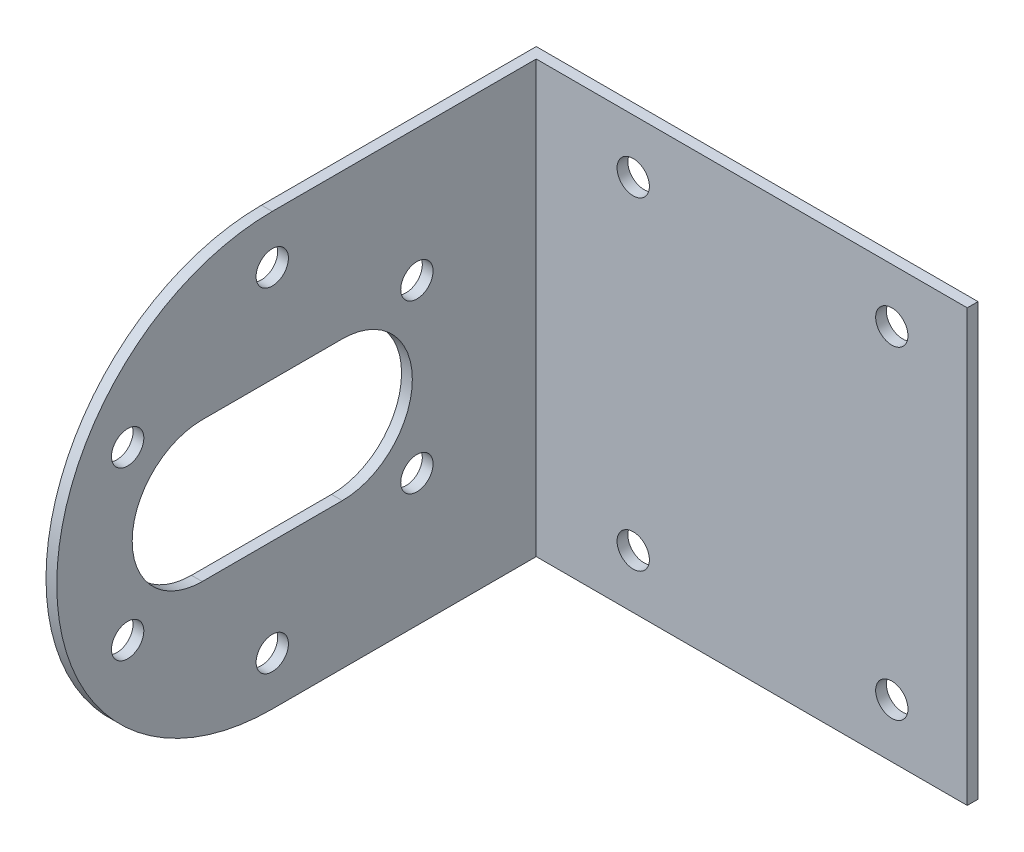
ISO-10303-21;
HEADER;
FILE_DESCRIPTION(('STEP AP214'),'2;1');
FILE_NAME('part.step','',(''),(''),'','','');
FILE_SCHEMA(('AUTOMOTIVE_DESIGN { 1 0 10303 214 1 1 1 1 }'));
ENDSEC;
DATA;
#1=APPLICATION_CONTEXT('core data for automotive mechanical design processes');
#2=APPLICATION_PROTOCOL_DEFINITION('international standard','automotive_design',2000,#1);
#3=PRODUCT_CONTEXT('',#1,'mechanical');
#4=PRODUCT('Part','Part','',(#3));
#5=PRODUCT_RELATED_PRODUCT_CATEGORY('part','',(#4));
#6=PRODUCT_DEFINITION_FORMATION('','',#4);
#7=PRODUCT_DEFINITION_CONTEXT('part definition',#1,'design');
#8=PRODUCT_DEFINITION('design','',#6,#7);
#9=PRODUCT_DEFINITION_SHAPE('','',#8);
#10=(LENGTH_UNIT() NAMED_UNIT(*) SI_UNIT(.MILLI.,.METRE.));
#11=(NAMED_UNIT(*) PLANE_ANGLE_UNIT() SI_UNIT($,.RADIAN.));
#12=(NAMED_UNIT(*) SI_UNIT($,.STERADIAN.) SOLID_ANGLE_UNIT());
#13=UNCERTAINTY_MEASURE_WITH_UNIT(LENGTH_MEASURE(1.E-05),#10,'distance_accuracy_value','');
#14=(GEOMETRIC_REPRESENTATION_CONTEXT(3) GLOBAL_UNCERTAINTY_ASSIGNED_CONTEXT((#13)) GLOBAL_UNIT_ASSIGNED_CONTEXT((#10,
#11,#12)) REPRESENTATION_CONTEXT('',''));
#15=CARTESIAN_POINT('',(0.,0.,0.));
#16=DIRECTION('',(0.,0.,1.));
#17=DIRECTION('',(1.,0.,0.));
#18=AXIS2_PLACEMENT_3D('',#15,#16,#17);
#19=CARTESIAN_POINT('',(0.,6.5,18.));
#20=DIRECTION('',(0.,-1.,0.));
#21=DIRECTION('',(0.,0.,-1.));
#22=AXIS2_PLACEMENT_3D('',#19,#20,#21);
#23=PLANE('',#22);
#24=DIRECTION('',(0.,0.,1.));
#25=VECTOR('',#24,1.);
#26=CARTESIAN_POINT('',(1.,6.5,0.));
#27=LINE('',#26,#25);
#28=CARTESIAN_POINT('',(1.,6.5,18.));
#29=VERTEX_POINT('',#28);
#30=CARTESIAN_POINT('',(1.,6.50000000000001,31.));
#31=VERTEX_POINT('',#30);
#32=EDGE_CURVE('E214',#29,#31,#27,.T.);
#33=ORIENTED_EDGE('',*,*,#32,.T.);
#34=DIRECTION('',(-1.,0.,0.));
#35=VECTOR('',#34,1.);
#36=CARTESIAN_POINT('',(0.,6.50000000000001,31.));
#37=LINE('',#36,#35);
#38=CARTESIAN_POINT('',(0.,6.5,31.));
#39=VERTEX_POINT('',#38);
#40=EDGE_CURVE('E109',#31,#39,#37,.T.);
#41=ORIENTED_EDGE('',*,*,#40,.T.);
#42=DIRECTION('',(0.,0.,-1.));
#43=VECTOR('',#42,1.);
#44=CARTESIAN_POINT('',(0.,6.5,0.));
#45=LINE('',#44,#43);
#46=CARTESIAN_POINT('',(0.,6.5,18.));
#47=VERTEX_POINT('',#46);
#48=EDGE_CURVE('E200',#39,#47,#45,.T.);
#49=ORIENTED_EDGE('',*,*,#48,.T.);
#50=DIRECTION('',(-1.,0.,0.));
#51=VECTOR('',#50,1.);
#52=CARTESIAN_POINT('',(0.,6.50000000000001,18.));
#53=LINE('',#52,#51);
#54=EDGE_CURVE('E132',#47,#29,#53,.F.);
#55=ORIENTED_EDGE('',*,*,#54,.T.);
#56=EDGE_LOOP('',(#33,#41,#49,#55));
#57=FACE_BOUND('',#56,.T.);
#58=ADVANCED_FACE('F17',(#57),#23,.T.);
#59=CARTESIAN_POINT('',(0.,7.75,37.923393758659));
#60=DIRECTION('',(-1.,0.,0.));
#61=DIRECTION('',(0.,0.,1.));
#62=AXIS2_PLACEMENT_3D('',#59,#60,#61);
#63=CYLINDRICAL_SURFACE('',#62,1.5);
#64=CARTESIAN_POINT('',(1.,7.75,37.923393758659));
#65=DIRECTION('',(-1.,0.,0.));
#66=DIRECTION('',(0.,0.,1.));
#67=AXIS2_PLACEMENT_3D('',#64,#65,#66);
#68=CIRCLE('',#67,1.5);
#69=CARTESIAN_POINT('',(0.999999999999999,7.75,39.423393758659));
#70=VERTEX_POINT('',#69);
#71=EDGE_CURVE('E218',#70,#70,#68,.F.);
#72=ORIENTED_EDGE('',*,*,#71,.T.);
#73=EDGE_LOOP('',(#72));
#74=FACE_BOUND('',#73,.T.);
#75=CARTESIAN_POINT('',(0.,7.75,37.923393758659));
#76=DIRECTION('',(-1.,0.,0.));
#77=DIRECTION('',(0.,0.,1.));
#78=AXIS2_PLACEMENT_3D('',#75,#76,#77);
#79=CIRCLE('',#78,1.5);
#80=CARTESIAN_POINT('',(0.,7.75,39.423393758659));
#81=VERTEX_POINT('',#80);
#82=EDGE_CURVE('E197',#81,#81,#79,.T.);
#83=ORIENTED_EDGE('',*,*,#82,.T.);
#84=EDGE_LOOP('',(#83));
#85=FACE_BOUND('',#84,.T.);
#86=ADVANCED_FACE('F345',(#74,#85),#63,.F.);
#87=CARTESIAN_POINT('',(0.,15.5,24.5));
#88=DIRECTION('',(-1.,0.,0.));
#89=DIRECTION('',(0.,0.,1.));
#90=AXIS2_PLACEMENT_3D('',#87,#88,#89);
#91=CYLINDRICAL_SURFACE('',#90,1.5);
#92=CARTESIAN_POINT('',(1.,15.5,24.5));
#93=DIRECTION('',(-1.,0.,0.));
#94=DIRECTION('',(0.,0.,1.));
#95=AXIS2_PLACEMENT_3D('',#92,#93,#94);
#96=CIRCLE('',#95,1.5);
#97=CARTESIAN_POINT('',(0.999999999999999,15.5,26.));
#98=VERTEX_POINT('',#97);
#99=EDGE_CURVE('E204',#98,#98,#96,.F.);
#100=ORIENTED_EDGE('',*,*,#99,.T.);
#101=EDGE_LOOP('',(#100));
#102=FACE_BOUND('',#101,.T.);
#103=CARTESIAN_POINT('',(0.,15.5,24.5));
#104=DIRECTION('',(-1.,0.,0.));
#105=DIRECTION('',(0.,0.,1.));
#106=AXIS2_PLACEMENT_3D('',#103,#104,#105);
#107=CIRCLE('',#106,1.5);
#108=CARTESIAN_POINT('',(0.,15.5,26.));
#109=VERTEX_POINT('',#108);
#110=EDGE_CURVE('E194',#109,#109,#107,.T.);
#111=ORIENTED_EDGE('',*,*,#110,.T.);
#112=EDGE_LOOP('',(#111));
#113=FACE_BOUND('',#112,.T.);
#114=ADVANCED_FACE('F342',(#102,#113),#91,.F.);
#115=CARTESIAN_POINT('',(0.,7.75,11.076606241341));
#116=DIRECTION('',(-1.,0.,0.));
#117=DIRECTION('',(0.,0.,1.));
#118=AXIS2_PLACEMENT_3D('',#115,#116,#117);
#119=CYLINDRICAL_SURFACE('',#118,1.5);
#120=CARTESIAN_POINT('',(1.,7.75,11.076606241341));
#121=DIRECTION('',(-1.,0.,0.));
#122=DIRECTION('',(0.,0.,1.));
#123=AXIS2_PLACEMENT_3D('',#120,#121,#122);
#124=CIRCLE('',#123,1.5);
#125=CARTESIAN_POINT('',(0.999999999999999,7.75,12.576606241341));
#126=VERTEX_POINT('',#125);
#127=EDGE_CURVE('E201',#126,#126,#124,.F.);
#128=ORIENTED_EDGE('',*,*,#127,.T.);
#129=EDGE_LOOP('',(#128));
#130=FACE_BOUND('',#129,.T.);
#131=CARTESIAN_POINT('',(0.,7.75,11.076606241341));
#132=DIRECTION('',(-1.,0.,0.));
#133=DIRECTION('',(0.,0.,1.));
#134=AXIS2_PLACEMENT_3D('',#131,#132,#133);
#135=CIRCLE('',#134,1.5);
#136=CARTESIAN_POINT('',(0.,7.75,12.576606241341));
#137=VERTEX_POINT('',#136);
#138=EDGE_CURVE('E191',#137,#137,#135,.T.);
#139=ORIENTED_EDGE('',*,*,#138,.T.);
#140=EDGE_LOOP('',(#139));
#141=FACE_BOUND('',#140,.T.);
#142=ADVANCED_FACE('F338',(#130,#141),#119,.F.);
#143=CARTESIAN_POINT('',(0.,0.,18.));
#144=DIRECTION('',(-1.,0.,0.));
#145=DIRECTION('',(0.,0.,1.));
#146=AXIS2_PLACEMENT_3D('',#143,#144,#145);
#147=CYLINDRICAL_SURFACE('',#146,6.5);
#148=DIRECTION('',(1.,0.,0.));
#149=VECTOR('',#148,1.);
#150=CARTESIAN_POINT('',(0.,-6.5,18.));
#151=LINE('',#150,#149);
#152=CARTESIAN_POINT('',(0.,-6.5,18.));
#153=VERTEX_POINT('',#152);
#154=CARTESIAN_POINT('',(0.999999999999999,-6.5,18.));
#155=VERTEX_POINT('',#154);
#156=EDGE_CURVE('E129',#153,#155,#151,.T.);
#157=ORIENTED_EDGE('',*,*,#156,.T.);
#158=CARTESIAN_POINT('',(0.999999999999999,0.,18.));
#159=DIRECTION('',(-1.,0.,0.));
#160=DIRECTION('',(0.,0.,1.));
#161=AXIS2_PLACEMENT_3D('',#158,#159,#160);
#162=CIRCLE('',#161,6.5);
#163=EDGE_CURVE('E215',#155,#29,#162,.F.);
#164=ORIENTED_EDGE('',*,*,#163,.T.);
#165=ORIENTED_EDGE('',*,*,#54,.F.);
#166=CARTESIAN_POINT('',(0.,0.,18.));
#167=DIRECTION('',(-1.,0.,0.));
#168=DIRECTION('',(0.,0.,1.));
#169=AXIS2_PLACEMENT_3D('',#166,#167,#168);
#170=CIRCLE('',#169,6.5);
#171=EDGE_CURVE('E188',#47,#153,#170,.T.);
#172=ORIENTED_EDGE('',*,*,#171,.T.);
#173=EDGE_LOOP('',(#157,#164,#165,#172));
#174=FACE_BOUND('',#173,.T.);
#175=ADVANCED_FACE('F334',(#174),#147,.F.);
#176=CARTESIAN_POINT('',(0.,-6.5,18.));
#177=DIRECTION('',(0.,-1.,0.));
#178=DIRECTION('',(0.,0.,-1.));
#179=AXIS2_PLACEMENT_3D('',#176,#177,#178);
#180=PLANE('',#179);
#181=DIRECTION('',(0.,0.,1.));
#182=VECTOR('',#181,1.);
#183=CARTESIAN_POINT('',(1.,-6.5,0.));
#184=LINE('',#183,#182);
#185=CARTESIAN_POINT('',(1.,-6.5,31.));
#186=VERTEX_POINT('',#185);
#187=EDGE_CURVE('E210',#186,#155,#184,.F.);
#188=ORIENTED_EDGE('',*,*,#187,.T.);
#189=ORIENTED_EDGE('',*,*,#156,.F.);
#190=DIRECTION('',(0.,0.,-1.));
#191=VECTOR('',#190,1.);
#192=CARTESIAN_POINT('',(0.,-6.5,0.));
#193=LINE('',#192,#191);
#194=CARTESIAN_POINT('',(0.,-6.5,31.));
#195=VERTEX_POINT('',#194);
#196=EDGE_CURVE('E187',#153,#195,#193,.F.);
#197=ORIENTED_EDGE('',*,*,#196,.T.);
#198=DIRECTION('',(-1.,0.,0.));
#199=VECTOR('',#198,1.);
#200=CARTESIAN_POINT('',(0.,-6.49999999999999,31.));
#201=LINE('',#200,#199);
#202=EDGE_CURVE('E127',#195,#186,#201,.F.);
#203=ORIENTED_EDGE('',*,*,#202,.T.);
#204=EDGE_LOOP('',(#188,#189,#197,#203));
#205=FACE_BOUND('',#204,.T.);
#206=ADVANCED_FACE('F330',(#205),#180,.F.);
#207=CARTESIAN_POINT('',(0.,0.,31.));
#208=DIRECTION('',(-1.,0.,0.));
#209=DIRECTION('',(0.,0.,1.));
#210=AXIS2_PLACEMENT_3D('',#207,#208,#209);
#211=CYLINDRICAL_SURFACE('',#210,6.5);
#212=ORIENTED_EDGE('',*,*,#40,.F.);
#213=CARTESIAN_POINT('',(1.,0.,31.));
#214=DIRECTION('',(-1.,0.,0.));
#215=DIRECTION('',(0.,0.,1.));
#216=AXIS2_PLACEMENT_3D('',#213,#214,#215);
#217=CIRCLE('',#216,6.5);
#218=EDGE_CURVE('E211',#31,#186,#217,.F.);
#219=ORIENTED_EDGE('',*,*,#218,.T.);
#220=ORIENTED_EDGE('',*,*,#202,.F.);
#221=CARTESIAN_POINT('',(0.,0.,31.));
#222=DIRECTION('',(-1.,0.,0.));
#223=DIRECTION('',(0.,0.,1.));
#224=AXIS2_PLACEMENT_3D('',#221,#222,#223);
#225=CIRCLE('',#224,6.5);
#226=EDGE_CURVE('E185',#195,#39,#225,.T.);
#227=ORIENTED_EDGE('',*,*,#226,.T.);
#228=EDGE_LOOP('',(#212,#219,#220,#227));
#229=FACE_BOUND('',#228,.T.);
#230=ADVANCED_FACE('F327',(#229),#211,.F.);
#231=CARTESIAN_POINT('',(0.,0.,24.5));
#232=DIRECTION('',(-1.,0.,0.));
#233=DIRECTION('',(0.,0.,1.));
#234=AXIS2_PLACEMENT_3D('',#231,#232,#233);
#235=CYLINDRICAL_SURFACE('',#234,20.);
#236=DIRECTION('',(1.,0.,0.));
#237=VECTOR('',#236,1.);
#238=CARTESIAN_POINT('',(0.,-20.,24.5));
#239=LINE('',#238,#237);
#240=CARTESIAN_POINT('',(0.,-20.,24.5));
#241=VERTEX_POINT('',#240);
#242=CARTESIAN_POINT('',(1.,-20.,24.5));
#243=VERTEX_POINT('',#242);
#244=EDGE_CURVE('E104',#241,#243,#239,.T.);
#245=ORIENTED_EDGE('',*,*,#244,.T.);
#246=CARTESIAN_POINT('',(1.,0.,24.5));
#247=DIRECTION('',(-1.,0.,0.));
#248=DIRECTION('',(0.,0.,1.));
#249=AXIS2_PLACEMENT_3D('',#246,#247,#248);
#250=CIRCLE('',#249,20.);
#251=CARTESIAN_POINT('',(1.00000000000001,19.9999999999995,24.5));
#252=VERTEX_POINT('',#251);
#253=EDGE_CURVE('E20',#243,#252,#250,.T.);
#254=ORIENTED_EDGE('',*,*,#253,.T.);
#255=DIRECTION('',(-1.,0.,0.));
#256=VECTOR('',#255,1.);
#257=CARTESIAN_POINT('',(0.,20.,24.5));
#258=LINE('',#257,#256);
#259=CARTESIAN_POINT('',(0.,20.0000000000005,24.5));
#260=VERTEX_POINT('',#259);
#261=EDGE_CURVE('E89',#252,#260,#258,.T.);
#262=ORIENTED_EDGE('',*,*,#261,.T.);
#263=CARTESIAN_POINT('',(0.,0.,24.5));
#264=DIRECTION('',(-1.,0.,0.));
#265=DIRECTION('',(0.,0.,1.));
#266=AXIS2_PLACEMENT_3D('',#263,#264,#265);
#267=CIRCLE('',#266,20.);
#268=EDGE_CURVE('E106',#260,#241,#267,.F.);
#269=ORIENTED_EDGE('',*,*,#268,.T.);
#270=EDGE_LOOP('',(#245,#254,#262,#269));
#271=FACE_BOUND('',#270,.T.);
#272=ADVANCED_FACE('F105',(#271),#235,.T.);
#273=CARTESIAN_POINT('',(0.,-7.75,37.923393758659));
#274=DIRECTION('',(-1.,0.,0.));
#275=DIRECTION('',(0.,0.,1.));
#276=AXIS2_PLACEMENT_3D('',#273,#274,#275);
#277=CYLINDRICAL_SURFACE('',#276,1.5);
#278=CARTESIAN_POINT('',(1.,-7.75,37.923393758659));
#279=DIRECTION('',(-1.,0.,0.));
#280=DIRECTION('',(0.,0.,1.));
#281=AXIS2_PLACEMENT_3D('',#278,#279,#280);
#282=CIRCLE('',#281,1.5);
#283=CARTESIAN_POINT('',(0.999999999999999,-7.75,39.423393758659));
#284=VERTEX_POINT('',#283);
#285=EDGE_CURVE('E223',#284,#284,#282,.F.);
#286=ORIENTED_EDGE('',*,*,#285,.T.);
#287=EDGE_LOOP('',(#286));
#288=FACE_BOUND('',#287,.T.);
#289=CARTESIAN_POINT('',(0.,-7.75,37.923393758659));
#290=DIRECTION('',(-1.,0.,0.));
#291=DIRECTION('',(0.,0.,1.));
#292=AXIS2_PLACEMENT_3D('',#289,#290,#291);
#293=CIRCLE('',#292,1.5);
#294=CARTESIAN_POINT('',(0.,-7.75,39.423393758659));
#295=VERTEX_POINT('',#294);
#296=EDGE_CURVE('E181',#295,#295,#293,.T.);
#297=ORIENTED_EDGE('',*,*,#296,.T.);
#298=EDGE_LOOP('',(#297));
#299=FACE_BOUND('',#298,.T.);
#300=ADVANCED_FACE('F321',(#288,#299),#277,.F.);
#301=CARTESIAN_POINT('',(0.,-15.5,24.5));
#302=DIRECTION('',(-1.,0.,0.));
#303=DIRECTION('',(0.,0.,1.));
#304=AXIS2_PLACEMENT_3D('',#301,#302,#303);
#305=CYLINDRICAL_SURFACE('',#304,1.5);
#306=CARTESIAN_POINT('',(1.,-15.5,24.5));
#307=DIRECTION('',(-1.,0.,0.));
#308=DIRECTION('',(0.,0.,1.));
#309=AXIS2_PLACEMENT_3D('',#306,#307,#308);
#310=CIRCLE('',#309,1.5);
#311=CARTESIAN_POINT('',(0.999999999999999,-15.5,26.));
#312=VERTEX_POINT('',#311);
#313=EDGE_CURVE('E221',#312,#312,#310,.F.);
#314=ORIENTED_EDGE('',*,*,#313,.T.);
#315=EDGE_LOOP('',(#314));
#316=FACE_BOUND('',#315,.T.);
#317=CARTESIAN_POINT('',(0.,-15.5,24.5));
#318=DIRECTION('',(-1.,0.,0.));
#319=DIRECTION('',(0.,0.,1.));
#320=AXIS2_PLACEMENT_3D('',#317,#318,#319);
#321=CIRCLE('',#320,1.5);
#322=CARTESIAN_POINT('',(0.,-15.5,26.));
#323=VERTEX_POINT('',#322);
#324=EDGE_CURVE('E178',#323,#323,#321,.T.);
#325=ORIENTED_EDGE('',*,*,#324,.T.);
#326=EDGE_LOOP('',(#325));
#327=FACE_BOUND('',#326,.T.);
#328=ADVANCED_FACE('F317',(#316,#327),#305,.F.);
#329=CARTESIAN_POINT('',(0.,-7.75,11.076606241341));
#330=DIRECTION('',(-1.,0.,0.));
#331=DIRECTION('',(0.,0.,1.));
#332=AXIS2_PLACEMENT_3D('',#329,#330,#331);
#333=CYLINDRICAL_SURFACE('',#332,1.5);
#334=CARTESIAN_POINT('',(1.,-7.75,11.076606241341));
#335=DIRECTION('',(-1.,0.,0.));
#336=DIRECTION('',(0.,0.,1.));
#337=AXIS2_PLACEMENT_3D('',#334,#335,#336);
#338=CIRCLE('',#337,1.5);
#339=CARTESIAN_POINT('',(0.999999999999999,-7.75,12.576606241341));
#340=VERTEX_POINT('',#339);
#341=EDGE_CURVE('E207',#340,#340,#338,.F.);
#342=ORIENTED_EDGE('',*,*,#341,.T.);
#343=EDGE_LOOP('',(#342));
#344=FACE_BOUND('',#343,.T.);
#345=CARTESIAN_POINT('',(0.,-7.75,11.076606241341));
#346=DIRECTION('',(-1.,0.,0.));
#347=DIRECTION('',(0.,0.,1.));
#348=AXIS2_PLACEMENT_3D('',#345,#346,#347);
#349=CIRCLE('',#348,1.5);
#350=CARTESIAN_POINT('',(0.,-7.75,12.576606241341));
#351=VERTEX_POINT('',#350);
#352=EDGE_CURVE('E143',#351,#351,#349,.T.);
#353=ORIENTED_EDGE('',*,*,#352,.T.);
#354=EDGE_LOOP('',(#353));
#355=FACE_BOUND('',#354,.T.);
#356=ADVANCED_FACE('F310',(#344,#355),#333,.F.);
#357=CARTESIAN_POINT('',(1.,-20.,0.));
#358=DIRECTION('',(-1.,0.,0.));
#359=DIRECTION('',(0.,0.,1.));
#360=AXIS2_PLACEMENT_3D('',#357,#358,#359);
#361=PLANE('',#360);
#362=ORIENTED_EDGE('',*,*,#127,.F.);
#363=EDGE_LOOP('',(#362));
#364=FACE_BOUND('',#363,.T.);
#365=ORIENTED_EDGE('',*,*,#99,.F.);
#366=EDGE_LOOP('',(#365));
#367=FACE_BOUND('',#366,.T.);
#368=ORIENTED_EDGE('',*,*,#341,.F.);
#369=EDGE_LOOP('',(#368));
#370=FACE_BOUND('',#369,.T.);
#371=ORIENTED_EDGE('',*,*,#218,.F.);
#372=ORIENTED_EDGE('',*,*,#32,.F.);
#373=ORIENTED_EDGE('',*,*,#163,.F.);
#374=ORIENTED_EDGE('',*,*,#187,.F.);
#375=EDGE_LOOP('',(#371,#372,#373,#374));
#376=FACE_BOUND('',#375,.T.);
#377=ORIENTED_EDGE('',*,*,#71,.F.);
#378=EDGE_LOOP('',(#377));
#379=FACE_BOUND('',#378,.T.);
#380=ORIENTED_EDGE('',*,*,#313,.F.);
#381=EDGE_LOOP('',(#380));
#382=FACE_BOUND('',#381,.T.);
#383=ORIENTED_EDGE('',*,*,#285,.F.);
#384=EDGE_LOOP('',(#383));
#385=FACE_BOUND('',#384,.T.);
#386=ORIENTED_EDGE('',*,*,#253,.F.);
#387=DIRECTION('',(0.,0.,1.));
#388=VECTOR('',#387,1.);
#389=CARTESIAN_POINT('',(1.,-20.,0.));
#390=LINE('',#389,#388);
#391=CARTESIAN_POINT('',(1.,-19.9999999999969,0.));
#392=VERTEX_POINT('',#391);
#393=EDGE_CURVE('E98',#392,#243,#390,.T.);
#394=ORIENTED_EDGE('',*,*,#393,.F.);
#395=DIRECTION('',(0.,1.,0.));
#396=VECTOR('',#395,1.);
#397=CARTESIAN_POINT('',(1.,4.64783E-12,0.));
#398=LINE('',#397,#396);
#399=CARTESIAN_POINT('',(1.,20.0000000000007,0.));
#400=VERTEX_POINT('',#399);
#401=EDGE_CURVE('E141',#400,#392,#398,.F.);
#402=ORIENTED_EDGE('',*,*,#401,.F.);
#403=DIRECTION('',(0.,0.,1.));
#404=VECTOR('',#403,1.);
#405=CARTESIAN_POINT('',(1.,19.999999999999,0.));
#406=LINE('',#405,#404);
#407=EDGE_CURVE('E100',#252,#400,#406,.F.);
#408=ORIENTED_EDGE('',*,*,#407,.F.);
#409=EDGE_LOOP('',(#386,#394,#402,#408));
#410=FACE_BOUND('',#409,.T.);
#411=ADVANCED_FACE('F95',(#364,#367,#370,#376,#379,#382,#385,#410),#361,.F.);
#412=CARTESIAN_POINT('',(20.5,4.64783E-12,0.));
#413=DIRECTION('',(0.,0.,1.));
#414=DIRECTION('',(1.,0.,0.));
#415=AXIS2_PLACEMENT_3D('',#412,#413,#414);
#416=PLANE('',#415);
#417=CARTESIAN_POINT('',(34.,15.000000000005,0.));
#418=DIRECTION('',(0.,0.,1.));
#419=DIRECTION('',(1.,0.,0.));
#420=AXIS2_PLACEMENT_3D('',#417,#418,#419);
#421=CIRCLE('',#420,1.5);
#422=CARTESIAN_POINT('',(35.5,15.000000000005,0.));
#423=VERTEX_POINT('',#422);
#424=EDGE_CURVE('E164',#423,#423,#421,.F.);
#425=ORIENTED_EDGE('',*,*,#424,.T.);
#426=EDGE_LOOP('',(#425));
#427=FACE_BOUND('',#426,.T.);
#428=CARTESIAN_POINT('',(10.,15.000000000005,0.));
#429=DIRECTION('',(0.,0.,1.));
#430=DIRECTION('',(1.,0.,0.));
#431=AXIS2_PLACEMENT_3D('',#428,#429,#430);
#432=CIRCLE('',#431,1.5);
#433=CARTESIAN_POINT('',(11.5,15.000000000005,0.));
#434=VERTEX_POINT('',#433);
#435=EDGE_CURVE('E171',#434,#434,#432,.F.);
#436=ORIENTED_EDGE('',*,*,#435,.T.);
#437=EDGE_LOOP('',(#436));
#438=FACE_BOUND('',#437,.T.);
#439=CARTESIAN_POINT('',(34.,-14.99999999999,0.));
#440=DIRECTION('',(0.,0.,1.));
#441=DIRECTION('',(1.,0.,0.));
#442=AXIS2_PLACEMENT_3D('',#439,#440,#441);
#443=CIRCLE('',#442,1.5);
#444=CARTESIAN_POINT('',(35.5,-14.99999999999,0.));
#445=VERTEX_POINT('',#444);
#446=EDGE_CURVE('E168',#445,#445,#443,.F.);
#447=ORIENTED_EDGE('',*,*,#446,.T.);
#448=EDGE_LOOP('',(#447));
#449=FACE_BOUND('',#448,.T.);
#450=CARTESIAN_POINT('',(10.,-14.99999999999,0.));
#451=DIRECTION('',(0.,0.,1.));
#452=DIRECTION('',(1.,0.,0.));
#453=AXIS2_PLACEMENT_3D('',#450,#451,#452);
#454=CIRCLE('',#453,1.5);
#455=CARTESIAN_POINT('',(11.5,-14.99999999999,0.));
#456=VERTEX_POINT('',#455);
#457=EDGE_CURVE('E124',#456,#456,#454,.F.);
#458=ORIENTED_EDGE('',*,*,#457,.T.);
#459=EDGE_LOOP('',(#458));
#460=FACE_BOUND('',#459,.T.);
#461=DIRECTION('',(0.,1.,0.));
#462=VECTOR('',#461,1.);
#463=CARTESIAN_POINT('',(41.,-19.99999999999,0.));
#464=LINE('',#463,#462);
#465=CARTESIAN_POINT('',(41.,20.000000000005,0.));
#466=VERTEX_POINT('',#465);
#467=CARTESIAN_POINT('',(41.,-19.9999999999925,0.));
#468=VERTEX_POINT('',#467);
#469=EDGE_CURVE('E237',#466,#468,#464,.F.);
#470=ORIENTED_EDGE('',*,*,#469,.F.);
#471=DIRECTION('',(1.,0.,0.));
#472=VECTOR('',#471,1.);
#473=CARTESIAN_POINT('',(41.,20.000000000005,0.));
#474=LINE('',#473,#472);
#475=EDGE_CURVE('E138',#400,#466,#474,.T.);
#476=ORIENTED_EDGE('',*,*,#475,.F.);
#477=ORIENTED_EDGE('',*,*,#401,.T.);
#478=DIRECTION('',(1.,0.,0.));
#479=VECTOR('',#478,1.);
#480=CARTESIAN_POINT('',(0.,-19.99999999999,0.));
#481=LINE('',#480,#479);
#482=EDGE_CURVE('E114',#468,#392,#481,.F.);
#483=ORIENTED_EDGE('',*,*,#482,.F.);
#484=EDGE_LOOP('',(#470,#476,#477,#483));
#485=FACE_BOUND('',#484,.T.);
#486=ADVANCED_FACE('F261',(#427,#438,#449,#460,#485),#416,.T.);
#487=CARTESIAN_POINT('',(0.,-19.99999999999,0.));
#488=DIRECTION('',(0.,-1.,0.));
#489=DIRECTION('',(0.,0.,-1.));
#490=AXIS2_PLACEMENT_3D('',#487,#488,#489);
#491=PLANE('',#490);
#492=ORIENTED_EDGE('',*,*,#482,.T.);
#493=ORIENTED_EDGE('',*,*,#393,.T.);
#494=ORIENTED_EDGE('',*,*,#244,.F.);
#495=DIRECTION('',(0.,0.,1.));
#496=VECTOR('',#495,1.);
#497=CARTESIAN_POINT('',(0.,-19.99999999999,0.));
#498=LINE('',#497,#496);
#499=CARTESIAN_POINT('',(0.,-19.99999999999,-1.));
#500=VERTEX_POINT('',#499);
#501=EDGE_CURVE('E122',#500,#241,#498,.T.);
#502=ORIENTED_EDGE('',*,*,#501,.F.);
#503=DIRECTION('',(1.,0.,0.));
#504=VECTOR('',#503,1.);
#505=CARTESIAN_POINT('',(20.5,-19.99999999999,-1.));
#506=LINE('',#505,#504);
#507=CARTESIAN_POINT('',(41.,-19.99999999999,-1.));
#508=VERTEX_POINT('',#507);
#509=EDGE_CURVE('E167',#500,#508,#506,.T.);
#510=ORIENTED_EDGE('',*,*,#509,.T.);
#511=DIRECTION('',(0.,0.,-1.));
#512=VECTOR('',#511,1.);
#513=CARTESIAN_POINT('',(41.,-19.99999999999,0.));
#514=LINE('',#513,#512);
#515=EDGE_CURVE('E152',#468,#508,#514,.T.);
#516=ORIENTED_EDGE('',*,*,#515,.F.);
#517=EDGE_LOOP('',(#492,#493,#494,#502,#510,#516));
#518=FACE_BOUND('',#517,.T.);
#519=ADVANCED_FACE('F112',(#518),#491,.T.);
#520=CARTESIAN_POINT('',(41.,-19.99999999999,0.));
#521=DIRECTION('',(1.,0.,0.));
#522=DIRECTION('',(0.,0.,-1.));
#523=AXIS2_PLACEMENT_3D('',#520,#521,#522);
#524=PLANE('',#523);
#525=DIRECTION('',(0.,0.,1.));
#526=VECTOR('',#525,1.);
#527=CARTESIAN_POINT('',(41.,20.000000000005,0.));
#528=LINE('',#527,#526);
#529=CARTESIAN_POINT('',(41.,20.000000000005,-1.));
#530=VERTEX_POINT('',#529);
#531=EDGE_CURVE('E148',#466,#530,#528,.F.);
#532=ORIENTED_EDGE('',*,*,#531,.F.);
#533=ORIENTED_EDGE('',*,*,#469,.T.);
#534=ORIENTED_EDGE('',*,*,#515,.T.);
#535=DIRECTION('',(0.,1.,0.));
#536=VECTOR('',#535,1.);
#537=CARTESIAN_POINT('',(41.,4.64783E-12,-1.));
#538=LINE('',#537,#536);
#539=EDGE_CURVE('E243',#508,#530,#538,.T.);
#540=ORIENTED_EDGE('',*,*,#539,.T.);
#541=EDGE_LOOP('',(#532,#533,#534,#540));
#542=FACE_BOUND('',#541,.T.);
#543=ADVANCED_FACE('F258',(#542),#524,.T.);
#544=CARTESIAN_POINT('',(41.,20.000000000005,0.));
#545=DIRECTION('',(0.,1.,0.));
#546=DIRECTION('',(0.,0.,1.));
#547=AXIS2_PLACEMENT_3D('',#544,#545,#546);
#548=PLANE('',#547);
#549=DIRECTION('',(0.,0.,1.));
#550=VECTOR('',#549,1.);
#551=CARTESIAN_POINT('',(0.,20.000000000001,0.));
#552=LINE('',#551,#550);
#553=CARTESIAN_POINT('',(0.,20.000000000004,-1.));
#554=VERTEX_POINT('',#553);
#555=EDGE_CURVE('E35',#260,#554,#552,.F.);
#556=ORIENTED_EDGE('',*,*,#555,.F.);
#557=ORIENTED_EDGE('',*,*,#261,.F.);
#558=ORIENTED_EDGE('',*,*,#407,.T.);
#559=ORIENTED_EDGE('',*,*,#475,.T.);
#560=ORIENTED_EDGE('',*,*,#531,.T.);
#561=DIRECTION('',(1.,0.,0.));
#562=VECTOR('',#561,1.);
#563=CARTESIAN_POINT('',(20.5,20.000000000005,-1.));
#564=LINE('',#563,#562);
#565=EDGE_CURVE('E246',#530,#554,#564,.F.);
#566=ORIENTED_EDGE('',*,*,#565,.T.);
#567=EDGE_LOOP('',(#556,#557,#558,#559,#560,#566));
#568=FACE_BOUND('',#567,.T.);
#569=ADVANCED_FACE('F262',(#568),#548,.T.);
#570=CARTESIAN_POINT('',(0.,0.,0.));
#571=DIRECTION('',(-1.,0.,0.));
#572=DIRECTION('',(0.,0.,1.));
#573=AXIS2_PLACEMENT_3D('',#570,#571,#572);
#574=PLANE('',#573);
#575=ORIENTED_EDGE('',*,*,#171,.F.);
#576=ORIENTED_EDGE('',*,*,#48,.F.);
#577=ORIENTED_EDGE('',*,*,#226,.F.);
#578=ORIENTED_EDGE('',*,*,#196,.F.);
#579=EDGE_LOOP('',(#575,#576,#577,#578));
#580=FACE_BOUND('',#579,.T.);
#581=ORIENTED_EDGE('',*,*,#268,.F.);
#582=ORIENTED_EDGE('',*,*,#555,.T.);
#583=DIRECTION('',(0.,1.,0.));
#584=VECTOR('',#583,1.);
#585=CARTESIAN_POINT('',(0.,4.64783E-12,-1.));
#586=LINE('',#585,#584);
#587=EDGE_CURVE('E163',#554,#500,#586,.F.);
#588=ORIENTED_EDGE('',*,*,#587,.T.);
#589=ORIENTED_EDGE('',*,*,#501,.T.);
#590=EDGE_LOOP('',(#581,#582,#588,#589));
#591=FACE_BOUND('',#590,.T.);
#592=ORIENTED_EDGE('',*,*,#352,.F.);
#593=EDGE_LOOP('',(#592));
#594=FACE_BOUND('',#593,.T.);
#595=ORIENTED_EDGE('',*,*,#324,.F.);
#596=EDGE_LOOP('',(#595));
#597=FACE_BOUND('',#596,.T.);
#598=ORIENTED_EDGE('',*,*,#296,.F.);
#599=EDGE_LOOP('',(#598));
#600=FACE_BOUND('',#599,.T.);
#601=ORIENTED_EDGE('',*,*,#138,.F.);
#602=EDGE_LOOP('',(#601));
#603=FACE_BOUND('',#602,.T.);
#604=ORIENTED_EDGE('',*,*,#110,.F.);
#605=EDGE_LOOP('',(#604));
#606=FACE_BOUND('',#605,.T.);
#607=ORIENTED_EDGE('',*,*,#82,.F.);
#608=EDGE_LOOP('',(#607));
#609=FACE_BOUND('',#608,.T.);
#610=ADVANCED_FACE('F250',(#580,#591,#594,#597,#600,#603,#606,#609),#574,.T.);
#611=CARTESIAN_POINT('',(10.,-14.99999999999,0.));
#612=DIRECTION('',(0.,0.,1.));
#613=DIRECTION('',(1.,0.,0.));
#614=AXIS2_PLACEMENT_3D('',#611,#612,#613);
#615=CYLINDRICAL_SURFACE('',#614,1.5);
#616=CARTESIAN_POINT('',(10.,-14.99999999999,-1.));
#617=DIRECTION('',(0.,0.,1.));
#618=DIRECTION('',(1.,0.,0.));
#619=AXIS2_PLACEMENT_3D('',#616,#617,#618);
#620=CIRCLE('',#619,1.5);
#621=CARTESIAN_POINT('',(11.5,-14.99999999999,-1.));
#622=VERTEX_POINT('',#621);
#623=EDGE_CURVE('E160',#622,#622,#620,.F.);
#624=ORIENTED_EDGE('',*,*,#623,.T.);
#625=EDGE_LOOP('',(#624));
#626=FACE_BOUND('',#625,.T.);
#627=ORIENTED_EDGE('',*,*,#457,.F.);
#628=EDGE_LOOP('',(#627));
#629=FACE_BOUND('',#628,.T.);
#630=ADVANCED_FACE('F270',(#626,#629),#615,.F.);
#631=CARTESIAN_POINT('',(10.,15.000000000005,0.));
#632=DIRECTION('',(0.,0.,1.));
#633=DIRECTION('',(1.,0.,0.));
#634=AXIS2_PLACEMENT_3D('',#631,#632,#633);
#635=CYLINDRICAL_SURFACE('',#634,1.5);
#636=CARTESIAN_POINT('',(10.,15.000000000005,-1.));
#637=DIRECTION('',(0.,0.,1.));
#638=DIRECTION('',(1.,0.,0.));
#639=AXIS2_PLACEMENT_3D('',#636,#637,#638);
#640=CIRCLE('',#639,1.5);
#641=CARTESIAN_POINT('',(11.5,15.000000000005,-1.));
#642=VERTEX_POINT('',#641);
#643=EDGE_CURVE('E157',#642,#642,#640,.F.);
#644=ORIENTED_EDGE('',*,*,#643,.T.);
#645=EDGE_LOOP('',(#644));
#646=FACE_BOUND('',#645,.T.);
#647=ORIENTED_EDGE('',*,*,#435,.F.);
#648=EDGE_LOOP('',(#647));
#649=FACE_BOUND('',#648,.T.);
#650=ADVANCED_FACE('F289',(#646,#649),#635,.F.);
#651=CARTESIAN_POINT('',(34.,-14.99999999999,0.));
#652=DIRECTION('',(0.,0.,1.));
#653=DIRECTION('',(1.,0.,0.));
#654=AXIS2_PLACEMENT_3D('',#651,#652,#653);
#655=CYLINDRICAL_SURFACE('',#654,1.5);
#656=CARTESIAN_POINT('',(34.,-14.99999999999,-1.));
#657=DIRECTION('',(0.,0.,1.));
#658=DIRECTION('',(1.,0.,0.));
#659=AXIS2_PLACEMENT_3D('',#656,#657,#658);
#660=CIRCLE('',#659,1.5);
#661=CARTESIAN_POINT('',(35.5,-14.99999999999,-1.));
#662=VERTEX_POINT('',#661);
#663=EDGE_CURVE('E26',#662,#662,#660,.F.);
#664=ORIENTED_EDGE('',*,*,#663,.T.);
#665=EDGE_LOOP('',(#664));
#666=FACE_BOUND('',#665,.T.);
#667=ORIENTED_EDGE('',*,*,#446,.F.);
#668=EDGE_LOOP('',(#667));
#669=FACE_BOUND('',#668,.T.);
#670=ADVANCED_FACE('F281',(#666,#669),#655,.F.);
#671=CARTESIAN_POINT('',(34.,15.000000000005,0.));
#672=DIRECTION('',(0.,0.,1.));
#673=DIRECTION('',(1.,0.,0.));
#674=AXIS2_PLACEMENT_3D('',#671,#672,#673);
#675=CYLINDRICAL_SURFACE('',#674,1.5);
#676=CARTESIAN_POINT('',(34.,15.000000000005,-1.));
#677=DIRECTION('',(0.,0.,1.));
#678=DIRECTION('',(1.,0.,0.));
#679=AXIS2_PLACEMENT_3D('',#676,#677,#678);
#680=CIRCLE('',#679,1.5);
#681=CARTESIAN_POINT('',(35.5,15.000000000005,-1.));
#682=VERTEX_POINT('',#681);
#683=EDGE_CURVE('E11',#682,#682,#680,.F.);
#684=ORIENTED_EDGE('',*,*,#683,.T.);
#685=EDGE_LOOP('',(#684));
#686=FACE_BOUND('',#685,.T.);
#687=ORIENTED_EDGE('',*,*,#424,.F.);
#688=EDGE_LOOP('',(#687));
#689=FACE_BOUND('',#688,.T.);
#690=ADVANCED_FACE('F275',(#686,#689),#675,.F.);
#691=CARTESIAN_POINT('',(20.5,4.64783E-12,-1.));
#692=DIRECTION('',(0.,0.,1.));
#693=DIRECTION('',(1.,0.,0.));
#694=AXIS2_PLACEMENT_3D('',#691,#692,#693);
#695=PLANE('',#694);
#696=ORIENTED_EDGE('',*,*,#683,.F.);
#697=EDGE_LOOP('',(#696));
#698=FACE_BOUND('',#697,.T.);
#699=ORIENTED_EDGE('',*,*,#663,.F.);
#700=EDGE_LOOP('',(#699));
#701=FACE_BOUND('',#700,.T.);
#702=ORIENTED_EDGE('',*,*,#643,.F.);
#703=EDGE_LOOP('',(#702));
#704=FACE_BOUND('',#703,.T.);
#705=ORIENTED_EDGE('',*,*,#623,.F.);
#706=EDGE_LOOP('',(#705));
#707=FACE_BOUND('',#706,.T.);
#708=ORIENTED_EDGE('',*,*,#587,.F.);
#709=ORIENTED_EDGE('',*,*,#565,.F.);
#710=ORIENTED_EDGE('',*,*,#539,.F.);
#711=ORIENTED_EDGE('',*,*,#509,.F.);
#712=EDGE_LOOP('',(#708,#709,#710,#711));
#713=FACE_BOUND('',#712,.T.);
#714=ADVANCED_FACE('F255',(#698,#701,#704,#707,#713),#695,.F.);
#715=CLOSED_SHELL('',(#58,#86,#114,#142,#175,#206,#230,#272,#300,#328,#356,#411,#486,#519,#543,
#569,#610,#630,#650,#670,#690,#714));
#716=MANIFOLD_SOLID_BREP('B1',#715);
#717=ADVANCED_BREP_SHAPE_REPRESENTATION('',(#18,#716),#14);
#718=SHAPE_DEFINITION_REPRESENTATION(#9,#717);
ENDSEC;
END-ISO-10303-21;
